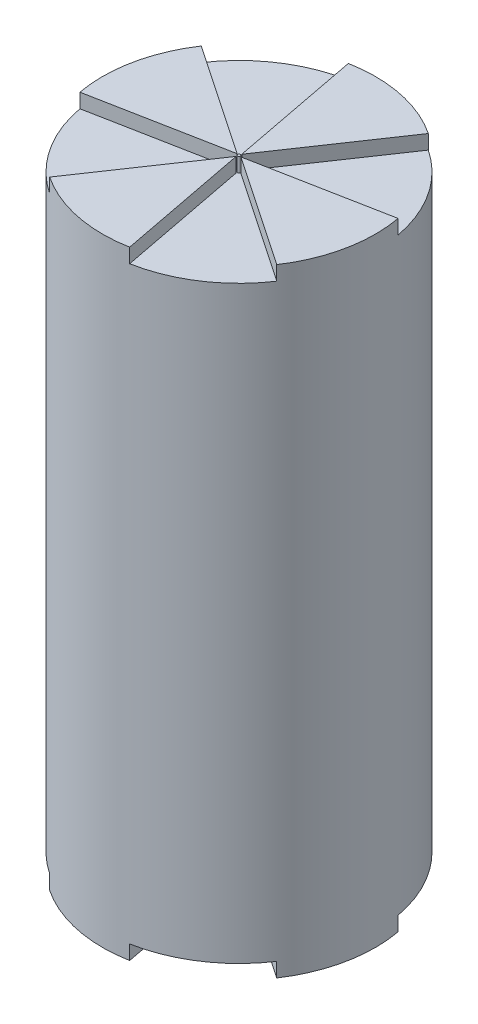
ISO-10303-21;
HEADER;
FILE_DESCRIPTION(('STEP AP214'),'2;1');
FILE_NAME('part.step','',(''),(''),'','','');
FILE_SCHEMA(('AUTOMOTIVE_DESIGN { 1 0 10303 214 1 1 1 1 }'));
ENDSEC;
DATA;
#1=APPLICATION_CONTEXT('core data for automotive mechanical design processes');
#2=APPLICATION_PROTOCOL_DEFINITION('international standard','automotive_design',2000,#1);
#3=PRODUCT_CONTEXT('',#1,'mechanical');
#4=PRODUCT('Part','Part','',(#3));
#5=PRODUCT_RELATED_PRODUCT_CATEGORY('part','',(#4));
#6=PRODUCT_DEFINITION_FORMATION('','',#4);
#7=PRODUCT_DEFINITION_CONTEXT('part definition',#1,'design');
#8=PRODUCT_DEFINITION('design','',#6,#7);
#9=PRODUCT_DEFINITION_SHAPE('','',#8);
#10=(LENGTH_UNIT() NAMED_UNIT(*) SI_UNIT(.MILLI.,.METRE.));
#11=(NAMED_UNIT(*) PLANE_ANGLE_UNIT() SI_UNIT($,.RADIAN.));
#12=(NAMED_UNIT(*) SI_UNIT($,.STERADIAN.) SOLID_ANGLE_UNIT());
#13=UNCERTAINTY_MEASURE_WITH_UNIT(LENGTH_MEASURE(1.E-05),#10,'distance_accuracy_value','');
#14=(GEOMETRIC_REPRESENTATION_CONTEXT(3) GLOBAL_UNCERTAINTY_ASSIGNED_CONTEXT((#13)) GLOBAL_UNIT_ASSIGNED_CONTEXT((#10,
#11,#12)) REPRESENTATION_CONTEXT('',''));
#15=CARTESIAN_POINT('',(0.,0.,0.));
#16=DIRECTION('',(0.,0.,1.));
#17=DIRECTION('',(1.,0.,0.));
#18=AXIS2_PLACEMENT_3D('',#15,#16,#17);
#19=CARTESIAN_POINT('',(0.,109.22,0.));
#20=DIRECTION('',(0.,-1.,0.));
#21=DIRECTION('',(0.,0.,-1.));
#22=AXIS2_PLACEMENT_3D('',#19,#20,#21);
#23=CYLINDRICAL_SURFACE('',#22,24.13);
#24=CARTESIAN_POINT('',(0.,106.68,0.));
#25=DIRECTION('',(0.,1.,0.));
#26=DIRECTION('',(-1.,0.,0.));
#27=AXIS2_PLACEMENT_3D('',#24,#25,#26);
#28=CIRCLE('',#27,24.13);
#29=CARTESIAN_POINT('',(4.39938854928725,106.68,23.725561750829));
#30=VERTEX_POINT('',#29);
#31=CARTESIAN_POINT('',(20.0683998357044,106.68,13.398366618148));
#32=VERTEX_POINT('',#31);
#33=EDGE_CURVE('E332',#30,#32,#28,.T.);
#34=ORIENTED_EDGE('',*,*,#33,.F.);
#35=DIRECTION('',(0.,1.,0.));
#36=VECTOR('',#35,1.);
#37=CARTESIAN_POINT('',(4.39938854928725,106.68,23.725561750829));
#38=LINE('',#37,#36);
#39=CARTESIAN_POINT('',(4.39938854928725,109.22,23.725561750829));
#40=VERTEX_POINT('',#39);
#41=EDGE_CURVE('E345',#30,#40,#38,.T.);
#42=ORIENTED_EDGE('',*,*,#41,.T.);
#43=CARTESIAN_POINT('',(0.,109.22,0.));
#44=DIRECTION('',(0.,1.,0.));
#45=DIRECTION('',(0.,0.,1.));
#46=AXIS2_PLACEMENT_3D('',#43,#44,#45);
#47=CIRCLE('',#46,24.13);
#48=CARTESIAN_POINT('',(-13.398366618148,109.22,20.0683998357043));
#49=VERTEX_POINT('',#48);
#50=EDGE_CURVE('E11',#49,#40,#47,.T.);
#51=ORIENTED_EDGE('',*,*,#50,.F.);
#52=DIRECTION('',(0.,1.,0.));
#53=VECTOR('',#52,1.);
#54=CARTESIAN_POINT('',(-13.398366618148,106.68,20.0683998357043));
#55=LINE('',#54,#53);
#56=CARTESIAN_POINT('',(-13.398366618148,106.68,20.0683998357043));
#57=VERTEX_POINT('',#56);
#58=EDGE_CURVE('E58',#57,#49,#55,.T.);
#59=ORIENTED_EDGE('',*,*,#58,.F.);
#60=CARTESIAN_POINT('',(0.,106.68,0.));
#61=DIRECTION('',(0.,1.,0.));
#62=DIRECTION('',(0.,0.,-1.));
#63=AXIS2_PLACEMENT_3D('',#60,#61,#62);
#64=CIRCLE('',#63,24.13);
#65=CARTESIAN_POINT('',(-23.725561750829,106.68,4.39938854928716));
#66=VERTEX_POINT('',#65);
#67=EDGE_CURVE('E356',#66,#57,#64,.T.);
#68=ORIENTED_EDGE('',*,*,#67,.F.);
#69=DIRECTION('',(0.,1.,0.));
#70=VECTOR('',#69,1.);
#71=CARTESIAN_POINT('',(-23.725561750829,106.68,4.39938854928716));
#72=LINE('',#71,#70);
#73=CARTESIAN_POINT('',(-23.725561750829,109.22,4.39938854928716));
#74=VERTEX_POINT('',#73);
#75=EDGE_CURVE('E374',#66,#74,#72,.T.);
#76=ORIENTED_EDGE('',*,*,#75,.T.);
#77=CARTESIAN_POINT('',(-20.0683998357044,109.22,-13.3983666181478));
#78=VERTEX_POINT('',#77);
#79=EDGE_CURVE('E43',#78,#74,#47,.T.);
#80=ORIENTED_EDGE('',*,*,#79,.F.);
#81=DIRECTION('',(0.,1.,0.));
#82=VECTOR('',#81,1.);
#83=CARTESIAN_POINT('',(-20.0683998357044,106.68,-13.3983666181478));
#84=LINE('',#83,#82);
#85=CARTESIAN_POINT('',(-20.0683998357044,106.68,-13.3983666181478));
#86=VERTEX_POINT('',#85);
#87=EDGE_CURVE('E302',#86,#78,#84,.T.);
#88=ORIENTED_EDGE('',*,*,#87,.F.);
#89=CARTESIAN_POINT('',(0.,106.68,0.));
#90=DIRECTION('',(0.,1.,0.));
#91=DIRECTION('',(1.,0.,0.));
#92=AXIS2_PLACEMENT_3D('',#89,#90,#91);
#93=CIRCLE('',#92,24.13);
#94=CARTESIAN_POINT('',(-4.39938854928741,106.68,-23.725561750829));
#95=VERTEX_POINT('',#94);
#96=EDGE_CURVE('E293',#95,#86,#93,.T.);
#97=ORIENTED_EDGE('',*,*,#96,.F.);
#98=DIRECTION('',(0.,1.,0.));
#99=VECTOR('',#98,1.);
#100=CARTESIAN_POINT('',(-4.39938854928741,106.68,-23.725561750829));
#101=LINE('',#100,#99);
#102=CARTESIAN_POINT('',(-4.39938854928741,109.22,-23.725561750829));
#103=VERTEX_POINT('',#102);
#104=EDGE_CURVE('E305',#95,#103,#101,.T.);
#105=ORIENTED_EDGE('',*,*,#104,.T.);
#106=CARTESIAN_POINT('',(13.398366618148,109.22,-20.0683998357043));
#107=VERTEX_POINT('',#106);
#108=EDGE_CURVE('E390',#107,#103,#47,.T.);
#109=ORIENTED_EDGE('',*,*,#108,.F.);
#110=DIRECTION('',(0.,1.,0.));
#111=VECTOR('',#110,1.);
#112=CARTESIAN_POINT('',(13.398366618148,106.68,-20.0683998357043));
#113=LINE('',#112,#111);
#114=CARTESIAN_POINT('',(13.398366618148,106.68,-20.0683998357043));
#115=VERTEX_POINT('',#114);
#116=EDGE_CURVE('E321',#115,#107,#113,.T.);
#117=ORIENTED_EDGE('',*,*,#116,.F.);
#118=CARTESIAN_POINT('',(0.,106.68,0.));
#119=DIRECTION('',(0.,1.,0.));
#120=DIRECTION('',(0.,0.,1.));
#121=AXIS2_PLACEMENT_3D('',#118,#119,#120);
#122=CIRCLE('',#121,24.13);
#123=CARTESIAN_POINT('',(23.725561750829,106.68,-4.39938854928716));
#124=VERTEX_POINT('',#123);
#125=EDGE_CURVE('E312',#124,#115,#122,.T.);
#126=ORIENTED_EDGE('',*,*,#125,.F.);
#127=DIRECTION('',(0.,1.,0.));
#128=VECTOR('',#127,1.);
#129=CARTESIAN_POINT('',(23.725561750829,106.68,-4.39938854928716));
#130=LINE('',#129,#128);
#131=CARTESIAN_POINT('',(23.725561750829,109.22,-4.39938854928716));
#132=VERTEX_POINT('',#131);
#133=EDGE_CURVE('E325',#124,#132,#130,.T.);
#134=ORIENTED_EDGE('',*,*,#133,.T.);
#135=CARTESIAN_POINT('',(20.0683998357044,109.22,13.398366618148));
#136=VERTEX_POINT('',#135);
#137=EDGE_CURVE('E42',#136,#132,#47,.T.);
#138=ORIENTED_EDGE('',*,*,#137,.F.);
#139=DIRECTION('',(0.,1.,0.));
#140=VECTOR('',#139,1.);
#141=CARTESIAN_POINT('',(20.0683998357044,106.68,13.398366618148));
#142=LINE('',#141,#140);
#143=EDGE_CURVE('E341',#32,#136,#142,.T.);
#144=ORIENTED_EDGE('',*,*,#143,.F.);
#145=EDGE_LOOP('',(#34,#42,#51,#59,#68,#76,#80,#88,#97,#105,#109,#117,#126,#134,#138,#144));
#146=FACE_BOUND('',#145,.T.);
#147=DIRECTION('',(0.,-1.,0.));
#148=VECTOR('',#147,1.);
#149=CARTESIAN_POINT('',(-13.398366618148,2.54,20.0683998357043));
#150=LINE('',#149,#148);
#151=CARTESIAN_POINT('',(-13.398366618148,2.54,20.0683998357043));
#152=VERTEX_POINT('',#151);
#153=CARTESIAN_POINT('',(-13.398366618148,0.,20.0683998357043));
#154=VERTEX_POINT('',#153);
#155=EDGE_CURVE('E289',#152,#154,#150,.T.);
#156=ORIENTED_EDGE('',*,*,#155,.T.);
#157=CARTESIAN_POINT('',(0.,0.,0.));
#158=DIRECTION('',(0.,1.,0.));
#159=DIRECTION('',(0.,0.,1.));
#160=AXIS2_PLACEMENT_3D('',#157,#158,#159);
#161=CIRCLE('',#160,24.13);
#162=CARTESIAN_POINT('',(4.39938854928725,0.,23.725561750829));
#163=VERTEX_POINT('',#162);
#164=EDGE_CURVE('E37',#154,#163,#161,.T.);
#165=ORIENTED_EDGE('',*,*,#164,.T.);
#166=DIRECTION('',(0.,-1.,0.));
#167=VECTOR('',#166,1.);
#168=CARTESIAN_POINT('',(4.39938854928725,2.54,23.725561750829));
#169=LINE('',#168,#167);
#170=CARTESIAN_POINT('',(4.39938854928725,2.54,23.725561750829));
#171=VERTEX_POINT('',#170);
#172=EDGE_CURVE('E253',#171,#163,#169,.T.);
#173=ORIENTED_EDGE('',*,*,#172,.F.);
#174=CARTESIAN_POINT('',(0.,2.54,0.));
#175=DIRECTION('',(0.,1.,0.));
#176=DIRECTION('',(-1.,0.,0.));
#177=AXIS2_PLACEMENT_3D('',#174,#175,#176);
#178=CIRCLE('',#177,24.13);
#179=CARTESIAN_POINT('',(20.0683998357044,2.54,13.398366618148));
#180=VERTEX_POINT('',#179);
#181=EDGE_CURVE('E244',#171,#180,#178,.T.);
#182=ORIENTED_EDGE('',*,*,#181,.T.);
#183=DIRECTION('',(0.,-1.,0.));
#184=VECTOR('',#183,1.);
#185=CARTESIAN_POINT('',(20.0683998357044,2.54,13.398366618148));
#186=LINE('',#185,#184);
#187=CARTESIAN_POINT('',(20.0683998357044,0.,13.398366618148));
#188=VERTEX_POINT('',#187);
#189=EDGE_CURVE('E258',#180,#188,#186,.T.);
#190=ORIENTED_EDGE('',*,*,#189,.T.);
#191=CARTESIAN_POINT('',(23.725561750829,0.,-4.39938854928716));
#192=VERTEX_POINT('',#191);
#193=EDGE_CURVE('E383',#188,#192,#161,.T.);
#194=ORIENTED_EDGE('',*,*,#193,.T.);
#195=DIRECTION('',(0.,-1.,0.));
#196=VECTOR('',#195,1.);
#197=CARTESIAN_POINT('',(23.725561750829,2.54,-4.39938854928716));
#198=LINE('',#197,#196);
#199=CARTESIAN_POINT('',(23.725561750829,2.54,-4.39938854928716));
#200=VERTEX_POINT('',#199);
#201=EDGE_CURVE('E233',#200,#192,#198,.T.);
#202=ORIENTED_EDGE('',*,*,#201,.F.);
#203=CARTESIAN_POINT('',(0.,2.54,0.));
#204=DIRECTION('',(0.,1.,0.));
#205=DIRECTION('',(0.,0.,1.));
#206=AXIS2_PLACEMENT_3D('',#203,#204,#205);
#207=CIRCLE('',#206,24.13);
#208=CARTESIAN_POINT('',(13.398366618148,2.54,-20.0683998357043));
#209=VERTEX_POINT('',#208);
#210=EDGE_CURVE('E225',#200,#209,#207,.T.);
#211=ORIENTED_EDGE('',*,*,#210,.T.);
#212=DIRECTION('',(0.,-1.,0.));
#213=VECTOR('',#212,1.);
#214=CARTESIAN_POINT('',(13.398366618148,2.54,-20.0683998357043));
#215=LINE('',#214,#213);
#216=CARTESIAN_POINT('',(13.398366618148,0.,-20.0683998357043));
#217=VERTEX_POINT('',#216);
#218=EDGE_CURVE('E238',#209,#217,#215,.T.);
#219=ORIENTED_EDGE('',*,*,#218,.T.);
#220=CARTESIAN_POINT('',(-4.39938854928741,0.,-23.725561750829));
#221=VERTEX_POINT('',#220);
#222=EDGE_CURVE('E217',#217,#221,#161,.T.);
#223=ORIENTED_EDGE('',*,*,#222,.T.);
#224=DIRECTION('',(0.,-1.,0.));
#225=VECTOR('',#224,1.);
#226=CARTESIAN_POINT('',(-4.39938854928741,2.54,-23.725561750829));
#227=LINE('',#226,#225);
#228=CARTESIAN_POINT('',(-4.39938854928741,2.54,-23.725561750829));
#229=VERTEX_POINT('',#228);
#230=EDGE_CURVE('E50',#229,#221,#227,.T.);
#231=ORIENTED_EDGE('',*,*,#230,.F.);
#232=CARTESIAN_POINT('',(0.,2.54,0.));
#233=DIRECTION('',(0.,1.,0.));
#234=DIRECTION('',(1.,0.,0.));
#235=AXIS2_PLACEMENT_3D('',#232,#233,#234);
#236=CIRCLE('',#235,24.13);
#237=CARTESIAN_POINT('',(-20.0683998357044,2.54,-13.3983666181478));
#238=VERTEX_POINT('',#237);
#239=EDGE_CURVE('E203',#229,#238,#236,.T.);
#240=ORIENTED_EDGE('',*,*,#239,.T.);
#241=DIRECTION('',(0.,-1.,0.));
#242=VECTOR('',#241,1.);
#243=CARTESIAN_POINT('',(-20.0683998357044,2.54,-13.3983666181478));
#244=LINE('',#243,#242);
#245=CARTESIAN_POINT('',(-20.0683998357044,0.,-13.3983666181478));
#246=VERTEX_POINT('',#245);
#247=EDGE_CURVE('E218',#238,#246,#244,.T.);
#248=ORIENTED_EDGE('',*,*,#247,.T.);
#249=CARTESIAN_POINT('',(-23.725561750829,0.,4.39938854928716));
#250=VERTEX_POINT('',#249);
#251=EDGE_CURVE('E382',#246,#250,#161,.T.);
#252=ORIENTED_EDGE('',*,*,#251,.T.);
#253=DIRECTION('',(0.,-1.,0.));
#254=VECTOR('',#253,1.);
#255=CARTESIAN_POINT('',(-23.725561750829,2.54,4.39938854928716));
#256=LINE('',#255,#254);
#257=CARTESIAN_POINT('',(-23.725561750829,2.54,4.39938854928716));
#258=VERTEX_POINT('',#257);
#259=EDGE_CURVE('E281',#258,#250,#256,.T.);
#260=ORIENTED_EDGE('',*,*,#259,.F.);
#261=CARTESIAN_POINT('',(0.,2.54,0.));
#262=DIRECTION('',(0.,1.,0.));
#263=DIRECTION('',(0.,0.,-1.));
#264=AXIS2_PLACEMENT_3D('',#261,#262,#263);
#265=CIRCLE('',#264,24.13);
#266=EDGE_CURVE('E269',#258,#152,#265,.T.);
#267=ORIENTED_EDGE('',*,*,#266,.T.);
#268=EDGE_LOOP('',(#156,#165,#173,#182,#190,#194,#202,#211,#219,#223,#231,#240,#248,#252,#260,#267));
#269=FACE_BOUND('',#268,.T.);
#270=ADVANCED_FACE('F34',(#146,#269),#23,.T.);
#271=CARTESIAN_POINT('',(0.,0.,0.));
#272=DIRECTION('',(0.,1.,0.));
#273=DIRECTION('',(0.,0.,1.));
#274=AXIS2_PLACEMENT_3D('',#271,#272,#273);
#275=PLANE('',#274);
#276=DIRECTION('',(0.560808959095651,0.,-0.827945234540337));
#277=VECTOR('',#276,1.);
#278=CARTESIAN_POINT('',(-13.398366618148,0.,20.0683998357043));
#279=LINE('',#278,#277);
#280=CARTESIAN_POINT('',(-0.0849040867862483,0.,0.413189840757915));
#281=VERTEX_POINT('',#280);
#282=EDGE_CURVE('E273',#154,#281,#279,.T.);
#283=ORIENTED_EDGE('',*,*,#282,.T.);
#284=DIRECTION('',(0.188893871867864,0.,0.98199750772126));
#285=VECTOR('',#284,1.);
#286=CARTESIAN_POINT('',(-0.121475110096735,0.,0.223069042287327));
#287=LINE('',#286,#285);
#288=EDGE_CURVE('E243',#281,#163,#287,.T.);
#289=ORIENTED_EDGE('',*,*,#288,.T.);
#290=ORIENTED_EDGE('',*,*,#164,.F.);
#291=EDGE_LOOP('',(#283,#289,#290));
#292=FACE_BOUND('',#291,.T.);
#293=ADVANCED_FACE('F449',(#292),#275,.F.);
#294=DIRECTION('',(-0.981997507721261,0.,0.188893871867861));
#295=VECTOR('',#294,1.);
#296=CARTESIAN_POINT('',(-0.223069042287327,0.,-0.121475110096735));
#297=LINE('',#296,#295);
#298=CARTESIAN_POINT('',(-0.413189840757908,0.,-0.0849040867862455));
#299=VERTEX_POINT('',#298);
#300=EDGE_CURVE('E268',#299,#250,#297,.T.);
#301=ORIENTED_EDGE('',*,*,#300,.T.);
#302=ORIENTED_EDGE('',*,*,#251,.F.);
#303=DIRECTION('',(0.827945234540343,0.,0.560808959095642));
#304=VECTOR('',#303,1.);
#305=CARTESIAN_POINT('',(-20.0683998357044,0.,-13.3983666181478));
#306=LINE('',#305,#304);
#307=EDGE_CURVE('E211',#246,#299,#306,.T.);
#308=ORIENTED_EDGE('',*,*,#307,.T.);
#309=EDGE_LOOP('',(#301,#302,#308));
#310=FACE_BOUND('',#309,.T.);
#311=ADVANCED_FACE('F453',(#310),#275,.F.);
#312=DIRECTION('',(-0.827945234540339,0.,-0.560808959095648));
#313=VECTOR('',#312,1.);
#314=CARTESIAN_POINT('',(20.0683998357044,0.,13.398366618148));
#315=LINE('',#314,#313);
#316=CARTESIAN_POINT('',(0.413189840757909,0.,0.084904086786247));
#317=VERTEX_POINT('',#316);
#318=EDGE_CURVE('E248',#188,#317,#315,.T.);
#319=ORIENTED_EDGE('',*,*,#318,.T.);
#320=DIRECTION('',(0.981997507721261,0.,-0.188893871867861));
#321=VECTOR('',#320,1.);
#322=CARTESIAN_POINT('',(0.223069042287327,0.,0.121475110096735));
#323=LINE('',#322,#321);
#324=EDGE_CURVE('E220',#317,#192,#323,.T.);
#325=ORIENTED_EDGE('',*,*,#324,.T.);
#326=ORIENTED_EDGE('',*,*,#193,.F.);
#327=EDGE_LOOP('',(#319,#325,#326));
#328=FACE_BOUND('',#327,.T.);
#329=ADVANCED_FACE('F459',(#328),#275,.F.);
#330=DIRECTION('',(-0.560808959095651,0.,0.827945234540337));
#331=VECTOR('',#330,1.);
#332=CARTESIAN_POINT('',(13.398366618148,0.,-20.0683998357043));
#333=LINE('',#332,#331);
#334=CARTESIAN_POINT('',(0.0849040867862416,0.,-0.413189840757899));
#335=VERTEX_POINT('',#334);
#336=EDGE_CURVE('E229',#217,#335,#333,.T.);
#337=ORIENTED_EDGE('',*,*,#336,.T.);
#338=DIRECTION('',(-0.188893871867871,0.,-0.981997507721259));
#339=VECTOR('',#338,1.);
#340=CARTESIAN_POINT('',(0.121475110096733,0.,-0.223069042287328));
#341=LINE('',#340,#339);
#342=EDGE_CURVE('E476',#335,#221,#341,.T.);
#343=ORIENTED_EDGE('',*,*,#342,.T.);
#344=ORIENTED_EDGE('',*,*,#222,.F.);
#345=EDGE_LOOP('',(#337,#343,#344));
#346=FACE_BOUND('',#345,.T.);
#347=ADVANCED_FACE('F463',(#346),#275,.F.);
#348=CARTESIAN_POINT('',(0.,109.22,0.));
#349=DIRECTION('',(0.,1.,0.));
#350=DIRECTION('',(0.,0.,1.));
#351=AXIS2_PLACEMENT_3D('',#348,#349,#350);
#352=PLANE('',#351);
#353=DIRECTION('',(0.188893871867864,0.,0.98199750772126));
#354=VECTOR('',#353,1.);
#355=CARTESIAN_POINT('',(-0.121475110096735,109.22,0.223069042287327));
#356=LINE('',#355,#354);
#357=CARTESIAN_POINT('',(-0.0849040867862434,109.22,0.413189840757894));
#358=VERTEX_POINT('',#357);
#359=EDGE_CURVE('E336',#358,#40,#356,.T.);
#360=ORIENTED_EDGE('',*,*,#359,.F.);
#361=DIRECTION('',(0.560808959095651,0.,-0.827945234540337));
#362=VECTOR('',#361,1.);
#363=CARTESIAN_POINT('',(-13.398366618148,109.22,20.0683998357043));
#364=LINE('',#363,#362);
#365=EDGE_CURVE('E355',#49,#358,#364,.T.);
#366=ORIENTED_EDGE('',*,*,#365,.F.);
#367=ORIENTED_EDGE('',*,*,#50,.T.);
#368=EDGE_LOOP('',(#360,#366,#367));
#369=FACE_BOUND('',#368,.T.);
#370=ADVANCED_FACE('F423',(#369),#352,.T.);
#371=CARTESIAN_POINT('',(0.,109.22,0.));
#372=DIRECTION('',(0.,-1.,0.));
#373=DIRECTION('',(0.,0.,-1.));
#374=AXIS2_PLACEMENT_3D('',#371,#372,#373);
#375=CIRCLE('',#374,0.253999999999996);
#376=CARTESIAN_POINT('',(0.,109.22,-0.253999999999996));
#377=VERTEX_POINT('',#376);
#378=EDGE_CURVE('E369',#377,#377,#375,.T.);
#379=ORIENTED_EDGE('',*,*,#378,.F.);
#380=EDGE_LOOP('',(#379));
#381=FACE_BOUND('',#380,.T.);
#382=ADVANCED_FACE('F446',(#381),#352,.T.);
#383=DIRECTION('',(-0.827945234540339,0.,-0.560808959095648));
#384=VECTOR('',#383,1.);
#385=CARTESIAN_POINT('',(20.0683998357044,109.22,13.398366618148));
#386=LINE('',#385,#384);
#387=CARTESIAN_POINT('',(0.413189840757908,109.22,0.0849040867862454));
#388=VERTEX_POINT('',#387);
#389=EDGE_CURVE('E331',#136,#388,#386,.T.);
#390=ORIENTED_EDGE('',*,*,#389,.F.);
#391=ORIENTED_EDGE('',*,*,#137,.T.);
#392=DIRECTION('',(0.981997507721261,0.,-0.188893871867861));
#393=VECTOR('',#392,1.);
#394=CARTESIAN_POINT('',(0.223069042287327,109.22,0.121475110096735));
#395=LINE('',#394,#393);
#396=EDGE_CURVE('E316',#388,#132,#395,.T.);
#397=ORIENTED_EDGE('',*,*,#396,.F.);
#398=EDGE_LOOP('',(#390,#391,#397));
#399=FACE_BOUND('',#398,.T.);
#400=ADVANCED_FACE('F404',(#399),#352,.T.);
#401=DIRECTION('',(-0.560808959095651,0.,0.827945234540337));
#402=VECTOR('',#401,1.);
#403=CARTESIAN_POINT('',(13.398366618148,109.22,-20.0683998357043));
#404=LINE('',#403,#402);
#405=CARTESIAN_POINT('',(0.0849040867862425,109.22,-0.413189840757902));
#406=VERTEX_POINT('',#405);
#407=EDGE_CURVE('E311',#107,#406,#404,.T.);
#408=ORIENTED_EDGE('',*,*,#407,.F.);
#409=ORIENTED_EDGE('',*,*,#108,.T.);
#410=DIRECTION('',(-0.188893871867871,0.,-0.981997507721259));
#411=VECTOR('',#410,1.);
#412=CARTESIAN_POINT('',(0.121475110096733,109.22,-0.223069042287328));
#413=LINE('',#412,#411);
#414=EDGE_CURVE('E297',#406,#103,#413,.T.);
#415=ORIENTED_EDGE('',*,*,#414,.F.);
#416=EDGE_LOOP('',(#408,#409,#415));
#417=FACE_BOUND('',#416,.T.);
#418=ADVANCED_FACE('F439',(#417),#352,.T.);
#419=DIRECTION('',(0.827945234540343,0.,0.560808959095642));
#420=VECTOR('',#419,1.);
#421=CARTESIAN_POINT('',(-20.0683998357044,109.22,-13.3983666181478));
#422=LINE('',#421,#420);
#423=CARTESIAN_POINT('',(-0.413189840757909,109.22,-0.0849040867862451));
#424=VERTEX_POINT('',#423);
#425=EDGE_CURVE('E291',#78,#424,#422,.T.);
#426=ORIENTED_EDGE('',*,*,#425,.F.);
#427=ORIENTED_EDGE('',*,*,#79,.T.);
#428=DIRECTION('',(-0.981997507721261,0.,0.188893871867861));
#429=VECTOR('',#428,1.);
#430=CARTESIAN_POINT('',(-0.223069042287327,109.22,-0.121475110096735));
#431=LINE('',#430,#429);
#432=EDGE_CURVE('E360',#424,#74,#431,.T.);
#433=ORIENTED_EDGE('',*,*,#432,.F.);
#434=EDGE_LOOP('',(#426,#427,#433));
#435=FACE_BOUND('',#434,.T.);
#436=ADVANCED_FACE('F428',(#435),#352,.T.);
#437=CARTESIAN_POINT('',(-0.223069042287327,106.68,-0.121475110096735));
#438=DIRECTION('',(-0.188893871867861,0.,-0.981997507721261));
#439=DIRECTION('',(-0.981997507721261,0.,0.188893871867861));
#440=AXIS2_PLACEMENT_3D('',#437,#438,#439);
#441=PLANE('',#440);
#442=DIRECTION('',(-0.981997507721261,0.,0.188893871867861));
#443=VECTOR('',#442,1.);
#444=CARTESIAN_POINT('',(-0.223069042287327,106.68,-0.121475110096735));
#445=LINE('',#444,#443);
#446=CARTESIAN_POINT('',(-0.413189840757909,106.68,-0.0849040867862451));
#447=VERTEX_POINT('',#446);
#448=EDGE_CURVE('E366',#447,#66,#445,.T.);
#449=ORIENTED_EDGE('',*,*,#448,.F.);
#450=DIRECTION('',(0.,1.,0.));
#451=VECTOR('',#450,1.);
#452=CARTESIAN_POINT('',(-0.413189840757908,106.68,-0.0849040867862454));
#453=LINE('',#452,#451);
#454=EDGE_CURVE('E348',#447,#424,#453,.T.);
#455=ORIENTED_EDGE('',*,*,#454,.T.);
#456=ORIENTED_EDGE('',*,*,#432,.T.);
#457=ORIENTED_EDGE('',*,*,#75,.F.);
#458=EDGE_LOOP('',(#449,#455,#456,#457));
#459=FACE_BOUND('',#458,.T.);
#460=ADVANCED_FACE('F427',(#459),#441,.F.);
#461=CARTESIAN_POINT('',(0.,106.68,0.));
#462=DIRECTION('',(0.,1.,0.));
#463=DIRECTION('',(0.,0.,1.));
#464=AXIS2_PLACEMENT_3D('',#461,#462,#463);
#465=CYLINDRICAL_SURFACE('',#464,0.253999999999996);
#466=ORIENTED_EDGE('',*,*,#378,.T.);
#467=EDGE_LOOP('',(#466));
#468=FACE_BOUND('',#467,.T.);
#469=CARTESIAN_POINT('',(0.,106.68,0.));
#470=DIRECTION('',(0.,-1.,0.));
#471=DIRECTION('',(0.,0.,-1.));
#472=AXIS2_PLACEMENT_3D('',#469,#470,#471);
#473=CIRCLE('',#472,0.253999999999996);
#474=CARTESIAN_POINT('',(0.,106.68,-0.253999999999996));
#475=VERTEX_POINT('',#474);
#476=EDGE_CURVE('E363',#475,#475,#473,.T.);
#477=ORIENTED_EDGE('',*,*,#476,.F.);
#478=EDGE_LOOP('',(#477));
#479=FACE_BOUND('',#478,.T.);
#480=ADVANCED_FACE('F546',(#468,#479),#465,.T.);
#481=CARTESIAN_POINT('',(-13.398366618148,106.68,20.0683998357043));
#482=DIRECTION('',(0.827945234540337,0.,0.560808959095651));
#483=DIRECTION('',(0.560808959095651,0.,-0.827945234540337));
#484=AXIS2_PLACEMENT_3D('',#481,#482,#483);
#485=PLANE('',#484);
#486=ORIENTED_EDGE('',*,*,#365,.T.);
#487=DIRECTION('',(0.,-1.,0.));
#488=VECTOR('',#487,1.);
#489=CARTESIAN_POINT('',(-0.0849040867862434,106.68,0.413189840757902));
#490=LINE('',#489,#488);
#491=CARTESIAN_POINT('',(-0.0849040867862429,106.68,0.413189840757914));
#492=VERTEX_POINT('',#491);
#493=EDGE_CURVE('E352',#358,#492,#490,.T.);
#494=ORIENTED_EDGE('',*,*,#493,.T.);
#495=DIRECTION('',(0.560808959095651,0.,-0.827945234540337));
#496=VECTOR('',#495,1.);
#497=CARTESIAN_POINT('',(-13.398366618148,106.68,20.0683998357043));
#498=LINE('',#497,#496);
#499=EDGE_CURVE('E359',#57,#492,#498,.T.);
#500=ORIENTED_EDGE('',*,*,#499,.F.);
#501=ORIENTED_EDGE('',*,*,#58,.T.);
#502=EDGE_LOOP('',(#486,#494,#500,#501));
#503=FACE_BOUND('',#502,.T.);
#504=ADVANCED_FACE('F424',(#503),#485,.F.);
#505=CARTESIAN_POINT('',(0.,106.68,0.));
#506=DIRECTION('',(0.,-1.,0.));
#507=DIRECTION('',(0.,0.,-1.));
#508=AXIS2_PLACEMENT_3D('',#505,#506,#507);
#509=PLANE('',#508);
#510=DIRECTION('',(0.827945234540343,0.,0.560808959095642));
#511=VECTOR('',#510,1.);
#512=CARTESIAN_POINT('',(-20.0683998357044,106.68,-13.3983666181478));
#513=LINE('',#512,#511);
#514=EDGE_CURVE('E296',#86,#447,#513,.T.);
#515=ORIENTED_EDGE('',*,*,#514,.T.);
#516=ORIENTED_EDGE('',*,*,#448,.T.);
#517=ORIENTED_EDGE('',*,*,#67,.T.);
#518=ORIENTED_EDGE('',*,*,#499,.T.);
#519=DIRECTION('',(0.188893871867864,0.,0.98199750772126));
#520=VECTOR('',#519,1.);
#521=CARTESIAN_POINT('',(-0.121475110096735,106.68,0.223069042287327));
#522=LINE('',#521,#520);
#523=EDGE_CURVE('E339',#492,#30,#522,.T.);
#524=ORIENTED_EDGE('',*,*,#523,.T.);
#525=ORIENTED_EDGE('',*,*,#33,.T.);
#526=DIRECTION('',(-0.827945234540339,0.,-0.560808959095648));
#527=VECTOR('',#526,1.);
#528=CARTESIAN_POINT('',(20.0683998357044,106.68,13.398366618148));
#529=LINE('',#528,#527);
#530=CARTESIAN_POINT('',(0.413189840757908,106.68,0.0849040867862454));
#531=VERTEX_POINT('',#530);
#532=EDGE_CURVE('E335',#32,#531,#529,.T.);
#533=ORIENTED_EDGE('',*,*,#532,.T.);
#534=DIRECTION('',(0.981997507721261,0.,-0.188893871867861));
#535=VECTOR('',#534,1.);
#536=CARTESIAN_POINT('',(0.223069042287327,106.68,0.121475110096735));
#537=LINE('',#536,#535);
#538=EDGE_CURVE('E319',#531,#124,#537,.T.);
#539=ORIENTED_EDGE('',*,*,#538,.T.);
#540=ORIENTED_EDGE('',*,*,#125,.T.);
#541=DIRECTION('',(-0.560808959095651,0.,0.827945234540337));
#542=VECTOR('',#541,1.);
#543=CARTESIAN_POINT('',(13.398366618148,106.68,-20.0683998357043));
#544=LINE('',#543,#542);
#545=CARTESIAN_POINT('',(0.0849040867862425,106.68,-0.413189840757902));
#546=VERTEX_POINT('',#545);
#547=EDGE_CURVE('E315',#115,#546,#544,.T.);
#548=ORIENTED_EDGE('',*,*,#547,.T.);
#549=DIRECTION('',(-0.188893871867871,0.,-0.981997507721259));
#550=VECTOR('',#549,1.);
#551=CARTESIAN_POINT('',(0.121475110096733,106.68,-0.223069042287328));
#552=LINE('',#551,#550);
#553=EDGE_CURVE('E300',#546,#95,#552,.T.);
#554=ORIENTED_EDGE('',*,*,#553,.T.);
#555=ORIENTED_EDGE('',*,*,#96,.T.);
#556=EDGE_LOOP('',(#515,#516,#517,#518,#524,#525,#533,#539,#540,#548,#554,#555));
#557=FACE_BOUND('',#556,.T.);
#558=ORIENTED_EDGE('',*,*,#476,.T.);
#559=EDGE_LOOP('',(#558));
#560=FACE_BOUND('',#559,.T.);
#561=ADVANCED_FACE('F416',(#557,#560),#509,.F.);
#562=CARTESIAN_POINT('',(-0.121475110096735,106.68,0.223069042287327));
#563=DIRECTION('',(-0.98199750772126,0.,0.188893871867864));
#564=DIRECTION('',(0.188893871867864,0.,0.981997507721261));
#565=AXIS2_PLACEMENT_3D('',#562,#563,#564);
#566=PLANE('',#565);
#567=ORIENTED_EDGE('',*,*,#359,.T.);
#568=ORIENTED_EDGE('',*,*,#41,.F.);
#569=ORIENTED_EDGE('',*,*,#523,.F.);
#570=ORIENTED_EDGE('',*,*,#493,.F.);
#571=EDGE_LOOP('',(#567,#568,#569,#570));
#572=FACE_BOUND('',#571,.T.);
#573=ADVANCED_FACE('F533',(#572),#566,.F.);
#574=CARTESIAN_POINT('',(-20.0683998357044,106.68,-13.3983666181478));
#575=DIRECTION('',(-0.560808959095642,0.,0.827945234540342));
#576=DIRECTION('',(0.827945234540343,0.,0.560808959095642));
#577=AXIS2_PLACEMENT_3D('',#574,#575,#576);
#578=PLANE('',#577);
#579=ORIENTED_EDGE('',*,*,#514,.F.);
#580=ORIENTED_EDGE('',*,*,#87,.T.);
#581=ORIENTED_EDGE('',*,*,#425,.T.);
#582=ORIENTED_EDGE('',*,*,#454,.F.);
#583=EDGE_LOOP('',(#579,#580,#581,#582));
#584=FACE_BOUND('',#583,.T.);
#585=ADVANCED_FACE('F432',(#584),#578,.F.);
#586=CARTESIAN_POINT('',(20.0683998357044,106.68,13.398366618148));
#587=DIRECTION('',(0.560808959095648,0.,-0.827945234540339));
#588=DIRECTION('',(-0.827945234540339,0.,-0.560808959095648));
#589=AXIS2_PLACEMENT_3D('',#586,#587,#588);
#590=PLANE('',#589);
#591=DIRECTION('',(0.,-1.,0.));
#592=VECTOR('',#591,1.);
#593=CARTESIAN_POINT('',(0.413189840757906,106.68,0.0849040867862468));
#594=LINE('',#593,#592);
#595=EDGE_CURVE('E328',#388,#531,#594,.T.);
#596=ORIENTED_EDGE('',*,*,#595,.T.);
#597=ORIENTED_EDGE('',*,*,#532,.F.);
#598=ORIENTED_EDGE('',*,*,#143,.T.);
#599=ORIENTED_EDGE('',*,*,#389,.T.);
#600=EDGE_LOOP('',(#596,#597,#598,#599));
#601=FACE_BOUND('',#600,.T.);
#602=ADVANCED_FACE('F414',(#601),#590,.F.);
#603=CARTESIAN_POINT('',(0.223069042287327,106.68,0.121475110096735));
#604=DIRECTION('',(0.188893871867861,0.,0.981997507721261));
#605=DIRECTION('',(0.981997507721261,0.,-0.188893871867861));
#606=AXIS2_PLACEMENT_3D('',#603,#604,#605);
#607=PLANE('',#606);
#608=ORIENTED_EDGE('',*,*,#396,.T.);
#609=ORIENTED_EDGE('',*,*,#133,.F.);
#610=ORIENTED_EDGE('',*,*,#538,.F.);
#611=ORIENTED_EDGE('',*,*,#595,.F.);
#612=EDGE_LOOP('',(#608,#609,#610,#611));
#613=FACE_BOUND('',#612,.T.);
#614=ADVANCED_FACE('F412',(#613),#607,.F.);
#615=CARTESIAN_POINT('',(13.398366618148,106.68,-20.0683998357043));
#616=DIRECTION('',(-0.827945234540337,0.,-0.560808959095651));
#617=DIRECTION('',(-0.560808959095651,0.,0.827945234540337));
#618=AXIS2_PLACEMENT_3D('',#615,#616,#617);
#619=PLANE('',#618);
#620=DIRECTION('',(0.,-1.,0.));
#621=VECTOR('',#620,1.);
#622=CARTESIAN_POINT('',(0.0849040867862434,106.68,-0.413189840757902));
#623=LINE('',#622,#621);
#624=EDGE_CURVE('E308',#406,#546,#623,.T.);
#625=ORIENTED_EDGE('',*,*,#624,.T.);
#626=ORIENTED_EDGE('',*,*,#547,.F.);
#627=ORIENTED_EDGE('',*,*,#116,.T.);
#628=ORIENTED_EDGE('',*,*,#407,.T.);
#629=EDGE_LOOP('',(#625,#626,#627,#628));
#630=FACE_BOUND('',#629,.T.);
#631=ADVANCED_FACE('F438',(#630),#619,.F.);
#632=CARTESIAN_POINT('',(0.121475110096733,106.68,-0.223069042287328));
#633=DIRECTION('',(0.981997507721259,0.,-0.188893871867871));
#634=DIRECTION('',(-0.188893871867871,0.,-0.981997507721259));
#635=AXIS2_PLACEMENT_3D('',#632,#633,#634);
#636=PLANE('',#635);
#637=ORIENTED_EDGE('',*,*,#414,.T.);
#638=ORIENTED_EDGE('',*,*,#104,.F.);
#639=ORIENTED_EDGE('',*,*,#553,.F.);
#640=ORIENTED_EDGE('',*,*,#624,.F.);
#641=EDGE_LOOP('',(#637,#638,#639,#640));
#642=FACE_BOUND('',#641,.T.);
#643=ADVANCED_FACE('F436',(#642),#636,.F.);
#644=CARTESIAN_POINT('',(-13.398366618148,2.54,20.0683998357043));
#645=DIRECTION('',(-0.827945234540337,0.,-0.560808959095651));
#646=DIRECTION('',(-0.560808959095651,0.,0.827945234540337));
#647=AXIS2_PLACEMENT_3D('',#644,#645,#646);
#648=PLANE('',#647);
#649=DIRECTION('',(0.,-1.,0.));
#650=VECTOR('',#649,1.);
#651=CARTESIAN_POINT('',(-0.0849040867862434,2.54,0.413189840757902));
#652=LINE('',#651,#650);
#653=CARTESIAN_POINT('',(-0.0849040867862483,2.54,0.413189840757915));
#654=VERTEX_POINT('',#653);
#655=EDGE_CURVE('E266',#654,#281,#652,.T.);
#656=ORIENTED_EDGE('',*,*,#655,.T.);
#657=ORIENTED_EDGE('',*,*,#282,.F.);
#658=ORIENTED_EDGE('',*,*,#155,.F.);
#659=DIRECTION('',(0.560808959095651,0.,-0.827945234540337));
#660=VECTOR('',#659,1.);
#661=CARTESIAN_POINT('',(-13.398366618148,2.54,20.0683998357043));
#662=LINE('',#661,#660);
#663=EDGE_CURVE('E278',#152,#654,#662,.T.);
#664=ORIENTED_EDGE('',*,*,#663,.T.);
#665=EDGE_LOOP('',(#656,#657,#658,#664));
#666=FACE_BOUND('',#665,.T.);
#667=ADVANCED_FACE('F495',(#666),#648,.T.);
#668=CARTESIAN_POINT('',(-0.223069042287327,2.54,-0.121475110096735));
#669=DIRECTION('',(0.188893871867861,0.,0.981997507721261));
#670=DIRECTION('',(0.981997507721261,0.,-0.188893871867861));
#671=AXIS2_PLACEMENT_3D('',#668,#669,#670);
#672=PLANE('',#671);
#673=DIRECTION('',(0.,1.,0.));
#674=VECTOR('',#673,1.);
#675=CARTESIAN_POINT('',(-0.413189840757908,2.54,-0.0849040867862454));
#676=LINE('',#675,#674);
#677=CARTESIAN_POINT('',(-0.413189840757909,2.54,-0.0849040867862451));
#678=VERTEX_POINT('',#677);
#679=EDGE_CURVE('E263',#299,#678,#676,.T.);
#680=ORIENTED_EDGE('',*,*,#679,.T.);
#681=DIRECTION('',(-0.981997507721261,0.,0.188893871867861));
#682=VECTOR('',#681,1.);
#683=CARTESIAN_POINT('',(-0.223069042287327,2.54,-0.121475110096735));
#684=LINE('',#683,#682);
#685=EDGE_CURVE('E272',#678,#258,#684,.T.);
#686=ORIENTED_EDGE('',*,*,#685,.T.);
#687=ORIENTED_EDGE('',*,*,#259,.T.);
#688=ORIENTED_EDGE('',*,*,#300,.F.);
#689=EDGE_LOOP('',(#680,#686,#687,#688));
#690=FACE_BOUND('',#689,.T.);
#691=ADVANCED_FACE('F499',(#690),#672,.T.);
#692=CARTESIAN_POINT('',(0.,2.54,0.));
#693=DIRECTION('',(0.,-1.,0.));
#694=DIRECTION('',(0.,0.,-1.));
#695=AXIS2_PLACEMENT_3D('',#692,#693,#694);
#696=CYLINDRICAL_SURFACE('',#695,0.253999999999996);
#697=CARTESIAN_POINT('',(0.,0.,0.));
#698=DIRECTION('',(0.,-1.,0.));
#699=DIRECTION('',(0.,0.,-1.));
#700=AXIS2_PLACEMENT_3D('',#697,#698,#699);
#701=CIRCLE('',#700,0.253999999999996);
#702=CARTESIAN_POINT('',(0.,0.,-0.253999999999996));
#703=VERTEX_POINT('',#702);
#704=EDGE_CURVE('E284',#703,#703,#701,.T.);
#705=ORIENTED_EDGE('',*,*,#704,.F.);
#706=EDGE_LOOP('',(#705));
#707=FACE_BOUND('',#706,.T.);
#708=CARTESIAN_POINT('',(0.,2.54,0.));
#709=DIRECTION('',(0.,-1.,0.));
#710=DIRECTION('',(0.,0.,-1.));
#711=AXIS2_PLACEMENT_3D('',#708,#709,#710);
#712=CIRCLE('',#711,0.253999999999996);
#713=CARTESIAN_POINT('',(0.,2.54,-0.253999999999996));
#714=VERTEX_POINT('',#713);
#715=EDGE_CURVE('E275',#714,#714,#712,.T.);
#716=ORIENTED_EDGE('',*,*,#715,.T.);
#717=EDGE_LOOP('',(#716));
#718=FACE_BOUND('',#717,.T.);
#719=ADVANCED_FACE('F520',(#707,#718),#696,.T.);
#720=CARTESIAN_POINT('',(0.,2.54,0.));
#721=DIRECTION('',(0.,1.,0.));
#722=DIRECTION('',(0.,0.,-1.));
#723=AXIS2_PLACEMENT_3D('',#720,#721,#722);
#724=PLANE('',#723);
#725=ORIENTED_EDGE('',*,*,#715,.F.);
#726=EDGE_LOOP('',(#725));
#727=FACE_BOUND('',#726,.T.);
#728=ORIENTED_EDGE('',*,*,#663,.F.);
#729=ORIENTED_EDGE('',*,*,#266,.F.);
#730=ORIENTED_EDGE('',*,*,#685,.F.);
#731=DIRECTION('',(0.827945234540343,0.,0.560808959095642));
#732=VECTOR('',#731,1.);
#733=CARTESIAN_POINT('',(-20.0683998357044,2.54,-13.3983666181478));
#734=LINE('',#733,#732);
#735=EDGE_CURVE('E202',#238,#678,#734,.T.);
#736=ORIENTED_EDGE('',*,*,#735,.F.);
#737=ORIENTED_EDGE('',*,*,#239,.F.);
#738=DIRECTION('',(-0.188893871867871,0.,-0.981997507721259));
#739=VECTOR('',#738,1.);
#740=CARTESIAN_POINT('',(0.121475110096733,2.54,-0.223069042287328));
#741=LINE('',#740,#739);
#742=CARTESIAN_POINT('',(0.0849040867862416,2.54,-0.413189840757899));
#743=VERTEX_POINT('',#742);
#744=EDGE_CURVE('E196',#743,#229,#741,.T.);
#745=ORIENTED_EDGE('',*,*,#744,.F.);
#746=DIRECTION('',(-0.560808959095651,0.,0.827945234540337));
#747=VECTOR('',#746,1.);
#748=CARTESIAN_POINT('',(13.398366618148,2.54,-20.0683998357043));
#749=LINE('',#748,#747);
#750=EDGE_CURVE('E231',#209,#743,#749,.T.);
#751=ORIENTED_EDGE('',*,*,#750,.F.);
#752=ORIENTED_EDGE('',*,*,#210,.F.);
#753=DIRECTION('',(0.981997507721261,0.,-0.188893871867861));
#754=VECTOR('',#753,1.);
#755=CARTESIAN_POINT('',(0.223069042287327,2.54,0.121475110096735));
#756=LINE('',#755,#754);
#757=CARTESIAN_POINT('',(0.413189840757909,2.54,0.084904086786247));
#758=VERTEX_POINT('',#757);
#759=EDGE_CURVE('E228',#758,#200,#756,.T.);
#760=ORIENTED_EDGE('',*,*,#759,.F.);
#761=DIRECTION('',(-0.827945234540339,0.,-0.560808959095648));
#762=VECTOR('',#761,1.);
#763=CARTESIAN_POINT('',(20.0683998357044,2.54,13.398366618148));
#764=LINE('',#763,#762);
#765=EDGE_CURVE('E250',#180,#758,#764,.T.);
#766=ORIENTED_EDGE('',*,*,#765,.F.);
#767=ORIENTED_EDGE('',*,*,#181,.F.);
#768=DIRECTION('',(0.188893871867864,0.,0.98199750772126));
#769=VECTOR('',#768,1.);
#770=CARTESIAN_POINT('',(-0.121475110096735,2.54,0.223069042287327));
#771=LINE('',#770,#769);
#772=EDGE_CURVE('E247',#654,#171,#771,.T.);
#773=ORIENTED_EDGE('',*,*,#772,.F.);
#774=EDGE_LOOP('',(#728,#729,#730,#736,#737,#745,#751,#752,#760,#766,#767,#773));
#775=FACE_BOUND('',#774,.T.);
#776=ADVANCED_FACE('F206',(#727,#775),#724,.F.);
#777=CARTESIAN_POINT('',(-0.121475110096735,2.54,0.223069042287327));
#778=DIRECTION('',(0.98199750772126,0.,-0.188893871867864));
#779=DIRECTION('',(-0.188893871867864,0.,-0.981997507721261));
#780=AXIS2_PLACEMENT_3D('',#777,#778,#779);
#781=PLANE('',#780);
#782=ORIENTED_EDGE('',*,*,#772,.T.);
#783=ORIENTED_EDGE('',*,*,#172,.T.);
#784=ORIENTED_EDGE('',*,*,#288,.F.);
#785=ORIENTED_EDGE('',*,*,#655,.F.);
#786=EDGE_LOOP('',(#782,#783,#784,#785));
#787=FACE_BOUND('',#786,.T.);
#788=ADVANCED_FACE('F492',(#787),#781,.T.);
#789=CARTESIAN_POINT('',(-20.0683998357044,2.54,-13.3983666181478));
#790=DIRECTION('',(0.560808959095642,0.,-0.827945234540342));
#791=DIRECTION('',(-0.827945234540343,0.,-0.560808959095642));
#792=AXIS2_PLACEMENT_3D('',#789,#790,#791);
#793=PLANE('',#792);
#794=ORIENTED_EDGE('',*,*,#307,.F.);
#795=ORIENTED_EDGE('',*,*,#247,.F.);
#796=ORIENTED_EDGE('',*,*,#735,.T.);
#797=ORIENTED_EDGE('',*,*,#679,.F.);
#798=EDGE_LOOP('',(#794,#795,#796,#797));
#799=FACE_BOUND('',#798,.T.);
#800=ADVANCED_FACE('F502',(#799),#793,.T.);
#801=CARTESIAN_POINT('',(13.398366618148,2.54,-20.0683998357043));
#802=DIRECTION('',(0.827945234540337,0.,0.560808959095651));
#803=DIRECTION('',(0.560808959095651,0.,-0.827945234540337));
#804=AXIS2_PLACEMENT_3D('',#801,#802,#803);
#805=PLANE('',#804);
#806=DIRECTION('',(0.,-1.,0.));
#807=VECTOR('',#806,1.);
#808=CARTESIAN_POINT('',(0.0849040867862434,2.54,-0.413189840757902));
#809=LINE('',#808,#807);
#810=EDGE_CURVE('E199',#743,#335,#809,.T.);
#811=ORIENTED_EDGE('',*,*,#810,.T.);
#812=ORIENTED_EDGE('',*,*,#336,.F.);
#813=ORIENTED_EDGE('',*,*,#218,.F.);
#814=ORIENTED_EDGE('',*,*,#750,.T.);
#815=EDGE_LOOP('',(#811,#812,#813,#814));
#816=FACE_BOUND('',#815,.T.);
#817=ADVANCED_FACE('F479',(#816),#805,.T.);
#818=CARTESIAN_POINT('',(20.0683998357044,2.54,13.398366618148));
#819=DIRECTION('',(-0.560808959095648,0.,0.827945234540339));
#820=DIRECTION('',(0.827945234540339,0.,0.560808959095648));
#821=AXIS2_PLACEMENT_3D('',#818,#819,#820);
#822=PLANE('',#821);
#823=DIRECTION('',(0.,-1.,0.));
#824=VECTOR('',#823,1.);
#825=CARTESIAN_POINT('',(0.413189840757906,2.54,0.0849040867862468));
#826=LINE('',#825,#824);
#827=EDGE_CURVE('E240',#758,#317,#826,.T.);
#828=ORIENTED_EDGE('',*,*,#827,.T.);
#829=ORIENTED_EDGE('',*,*,#318,.F.);
#830=ORIENTED_EDGE('',*,*,#189,.F.);
#831=ORIENTED_EDGE('',*,*,#765,.T.);
#832=EDGE_LOOP('',(#828,#829,#830,#831));
#833=FACE_BOUND('',#832,.T.);
#834=ADVANCED_FACE('F487',(#833),#822,.T.);
#835=CARTESIAN_POINT('',(0.223069042287327,2.54,0.121475110096735));
#836=DIRECTION('',(-0.188893871867861,0.,-0.981997507721261));
#837=DIRECTION('',(-0.981997507721261,0.,0.188893871867861));
#838=AXIS2_PLACEMENT_3D('',#835,#836,#837);
#839=PLANE('',#838);
#840=ORIENTED_EDGE('',*,*,#759,.T.);
#841=ORIENTED_EDGE('',*,*,#201,.T.);
#842=ORIENTED_EDGE('',*,*,#324,.F.);
#843=ORIENTED_EDGE('',*,*,#827,.F.);
#844=EDGE_LOOP('',(#840,#841,#842,#843));
#845=FACE_BOUND('',#844,.T.);
#846=ADVANCED_FACE('F467',(#845),#839,.T.);
#847=CARTESIAN_POINT('',(0.121475110096733,2.54,-0.223069042287328));
#848=DIRECTION('',(-0.981997507721259,0.,0.188893871867871));
#849=DIRECTION('',(0.188893871867871,0.,0.981997507721259));
#850=AXIS2_PLACEMENT_3D('',#847,#848,#849);
#851=PLANE('',#850);
#852=ORIENTED_EDGE('',*,*,#744,.T.);
#853=ORIENTED_EDGE('',*,*,#230,.T.);
#854=ORIENTED_EDGE('',*,*,#342,.F.);
#855=ORIENTED_EDGE('',*,*,#810,.F.);
#856=EDGE_LOOP('',(#852,#853,#854,#855));
#857=FACE_BOUND('',#856,.T.);
#858=ADVANCED_FACE('F198',(#857),#851,.T.);
#859=ORIENTED_EDGE('',*,*,#704,.T.);
#860=EDGE_LOOP('',(#859));
#861=FACE_BOUND('',#860,.T.);
#862=ADVANCED_FACE('F455',(#861),#275,.F.);
#863=CLOSED_SHELL('',(#270,#293,#311,#329,#347,#370,#382,#400,#418,#436,#460,#480,#504,#561,
#573,#585,#602,#614,#631,#643,#667,#691,#719,#776,#788,#800,#817,#834,#846,#858,#862));
#864=MANIFOLD_SOLID_BREP('B2',#863);
#865=ADVANCED_BREP_SHAPE_REPRESENTATION('',(#18,#864),#14);
#866=SHAPE_DEFINITION_REPRESENTATION(#9,#865);
ENDSEC;
END-ISO-10303-21;
